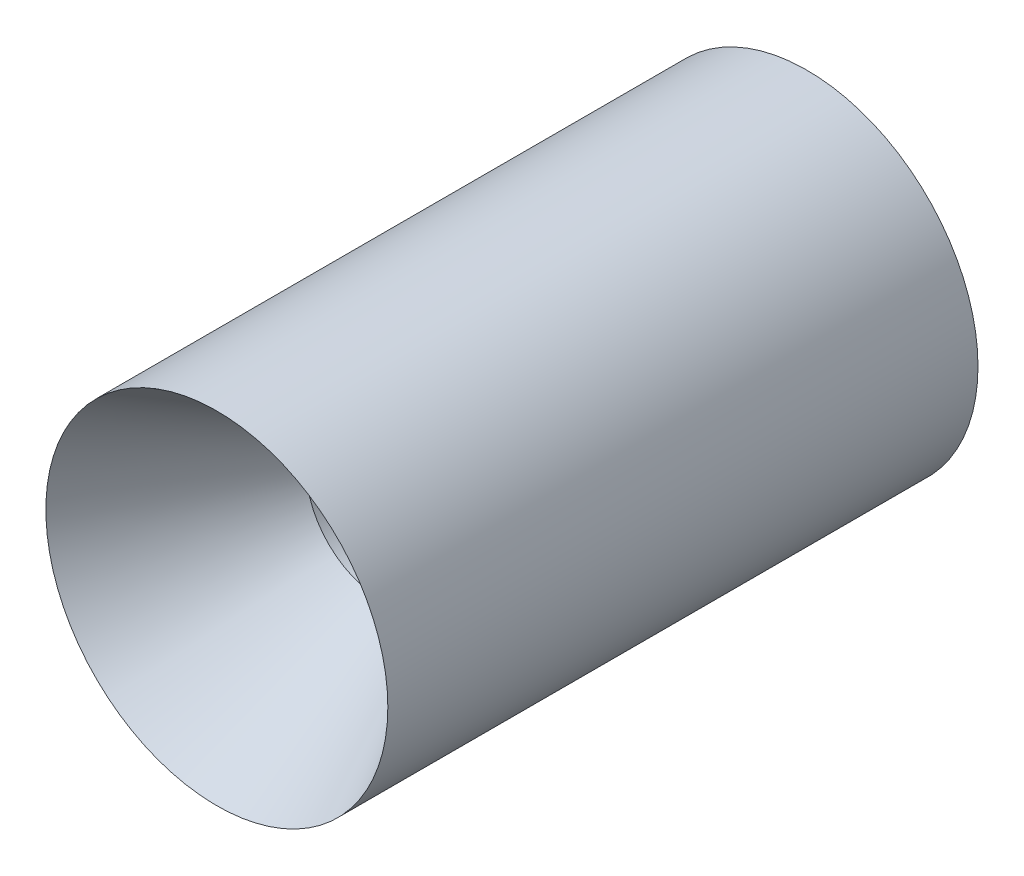
ISO-10303-21;
HEADER;
FILE_DESCRIPTION(('STEP AP214'),'2;1');
FILE_NAME('part.step','',(''),(''),'','','');
FILE_SCHEMA(('AUTOMOTIVE_DESIGN { 1 0 10303 214 1 1 1 1 }'));
ENDSEC;
DATA;
#1=APPLICATION_CONTEXT('core data for automotive mechanical design processes');
#2=APPLICATION_PROTOCOL_DEFINITION('international standard','automotive_design',2000,#1);
#3=PRODUCT_CONTEXT('',#1,'mechanical');
#4=PRODUCT('Part','Part','',(#3));
#5=PRODUCT_RELATED_PRODUCT_CATEGORY('part','',(#4));
#6=PRODUCT_DEFINITION_FORMATION('','',#4);
#7=PRODUCT_DEFINITION_CONTEXT('part definition',#1,'design');
#8=PRODUCT_DEFINITION('design','',#6,#7);
#9=PRODUCT_DEFINITION_SHAPE('','',#8);
#10=(LENGTH_UNIT() NAMED_UNIT(*) SI_UNIT(.MILLI.,.METRE.));
#11=(NAMED_UNIT(*) PLANE_ANGLE_UNIT() SI_UNIT($,.RADIAN.));
#12=(NAMED_UNIT(*) SI_UNIT($,.STERADIAN.) SOLID_ANGLE_UNIT());
#13=UNCERTAINTY_MEASURE_WITH_UNIT(LENGTH_MEASURE(1.E-05),#10,'distance_accuracy_value','');
#14=(GEOMETRIC_REPRESENTATION_CONTEXT(3) GLOBAL_UNCERTAINTY_ASSIGNED_CONTEXT((#13)) GLOBAL_UNIT_ASSIGNED_CONTEXT((#10,
#11,#12)) REPRESENTATION_CONTEXT('',''));
#15=CARTESIAN_POINT('',(0.,0.,0.));
#16=DIRECTION('',(0.,0.,1.));
#17=DIRECTION('',(1.,0.,0.));
#18=AXIS2_PLACEMENT_3D('',#15,#16,#17);
#19=CARTESIAN_POINT('',(0.,0.,0.));
#20=DIRECTION('',(0.,0.,1.));
#21=DIRECTION('',(1.,0.,0.));
#22=AXIS2_PLACEMENT_3D('',#19,#20,#21);
#23=CONICAL_SURFACE('',#22,14.351,0.5235987755983);
#24=CARTESIAN_POINT('',(0.,0.,-13.8581385113585));
#25=DIRECTION('',(0.,0.,1.));
#26=DIRECTION('',(1.,0.,0.));
#27=AXIS2_PLACEMENT_3D('',#24,#25,#26);
#28=CIRCLE('',#27,6.35);
#29=CARTESIAN_POINT('',(6.35,0.,-13.8581385113585));
#30=VERTEX_POINT('',#29);
#31=EDGE_CURVE('E10',#30,#30,#28,.T.);
#32=ORIENTED_EDGE('',*,*,#31,.F.);
#33=EDGE_LOOP('',(#32));
#34=FACE_BOUND('',#33,.T.);
#35=CARTESIAN_POINT('',(0.,0.,0.));
#36=DIRECTION('',(0.,0.,1.));
#37=DIRECTION('',(1.,0.,0.));
#38=AXIS2_PLACEMENT_3D('',#35,#36,#37);
#39=CIRCLE('',#38,14.351);
#40=CARTESIAN_POINT('',(14.351,0.,0.));
#41=VERTEX_POINT('',#40);
#42=EDGE_CURVE('E49',#41,#41,#39,.T.);
#43=ORIENTED_EDGE('',*,*,#42,.T.);
#44=EDGE_LOOP('',(#43));
#45=FACE_BOUND('',#44,.T.);
#46=ADVANCED_FACE('F30',(#34,#45),#23,.F.);
#47=CARTESIAN_POINT('',(0.,0.,0.));
#48=DIRECTION('',(0.,0.,1.));
#49=DIRECTION('',(1.,0.,0.));
#50=AXIS2_PLACEMENT_3D('',#47,#48,#49);
#51=CYLINDRICAL_SURFACE('',#50,6.35);
#52=CARTESIAN_POINT('',(0.,0.,-19.5576107688917));
#53=DIRECTION('',(0.,0.,1.));
#54=DIRECTION('',(1.,0.,0.));
#55=AXIS2_PLACEMENT_3D('',#52,#53,#54);
#56=CIRCLE('',#55,6.35);
#57=CARTESIAN_POINT('',(6.35,0.,-19.5576107688917));
#58=VERTEX_POINT('',#57);
#59=EDGE_CURVE('E36',#58,#58,#56,.T.);
#60=ORIENTED_EDGE('',*,*,#59,.F.);
#61=EDGE_LOOP('',(#60));
#62=FACE_BOUND('',#61,.T.);
#63=ORIENTED_EDGE('',*,*,#31,.T.);
#64=EDGE_LOOP('',(#63));
#65=FACE_BOUND('',#64,.T.);
#66=ADVANCED_FACE('F68',(#62,#65),#51,.F.);
#67=CARTESIAN_POINT('',(0.,0.,-19.5576107688917));
#68=DIRECTION('',(0.,0.,-1.));
#69=DIRECTION('',(-1.,0.,0.));
#70=AXIS2_PLACEMENT_3D('',#67,#68,#69);
#71=CONICAL_SURFACE('',#70,6.35,0.20943951023932);
#72=CARTESIAN_POINT('',(0.,0.,-49.53));
#73=DIRECTION('',(0.,0.,1.));
#74=DIRECTION('',(1.,0.,0.));
#75=AXIS2_PLACEMENT_3D('',#72,#73,#74);
#76=CIRCLE('',#75,12.720828);
#77=CARTESIAN_POINT('',(12.720828,0.,-49.53));
#78=VERTEX_POINT('',#77);
#79=EDGE_CURVE('E40',#78,#78,#76,.T.);
#80=ORIENTED_EDGE('',*,*,#79,.F.);
#81=EDGE_LOOP('',(#80));
#82=FACE_BOUND('',#81,.T.);
#83=ORIENTED_EDGE('',*,*,#59,.T.);
#84=EDGE_LOOP('',(#83));
#85=FACE_BOUND('',#84,.T.);
#86=ADVANCED_FACE('F63',(#82,#85),#71,.F.);
#87=CARTESIAN_POINT('',(0.,12.720828,-49.53));
#88=DIRECTION('',(0.,0.,1.));
#89=DIRECTION('',(1.,0.,0.));
#90=AXIS2_PLACEMENT_3D('',#87,#88,#89);
#91=PLANE('',#90);
#92=CARTESIAN_POINT('',(0.,0.,-49.53));
#93=DIRECTION('',(0.,0.,1.));
#94=DIRECTION('',(1.,0.,0.));
#95=AXIS2_PLACEMENT_3D('',#92,#93,#94);
#96=CIRCLE('',#95,14.351);
#97=CARTESIAN_POINT('',(14.351,0.,-49.53));
#98=VERTEX_POINT('',#97);
#99=EDGE_CURVE('E44',#98,#98,#96,.T.);
#100=ORIENTED_EDGE('',*,*,#99,.F.);
#101=EDGE_LOOP('',(#100));
#102=FACE_BOUND('',#101,.T.);
#103=ORIENTED_EDGE('',*,*,#79,.T.);
#104=EDGE_LOOP('',(#103));
#105=FACE_BOUND('',#104,.T.);
#106=ADVANCED_FACE('F57',(#102,#105),#91,.F.);
#107=CARTESIAN_POINT('',(0.,0.,0.));
#108=DIRECTION('',(0.,0.,1.));
#109=DIRECTION('',(1.,0.,0.));
#110=AXIS2_PLACEMENT_3D('',#107,#108,#109);
#111=CYLINDRICAL_SURFACE('',#110,14.351);
#112=ORIENTED_EDGE('',*,*,#42,.F.);
#113=EDGE_LOOP('',(#112));
#114=FACE_BOUND('',#113,.T.);
#115=ORIENTED_EDGE('',*,*,#99,.T.);
#116=EDGE_LOOP('',(#115));
#117=FACE_BOUND('',#116,.T.);
#118=ADVANCED_FACE('F54',(#114,#117),#111,.T.);
#119=CLOSED_SHELL('',(#46,#66,#86,#106,#118));
#120=MANIFOLD_SOLID_BREP('B2',#119);
#121=ADVANCED_BREP_SHAPE_REPRESENTATION('',(#18,#120),#14);
#122=SHAPE_DEFINITION_REPRESENTATION(#9,#121);
ENDSEC;
END-ISO-10303-21;
